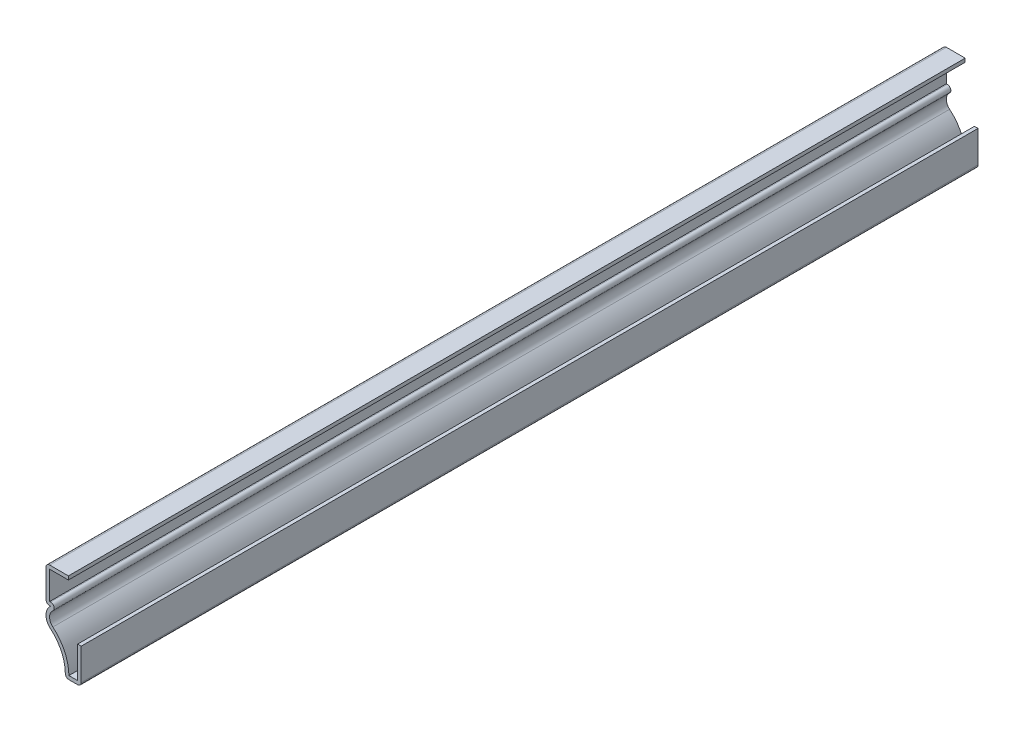
ISO-10303-21;
HEADER;
FILE_DESCRIPTION(('STEP AP214'),'2;1');
FILE_NAME('part.step','',(''),(''),'','','');
FILE_SCHEMA(('AUTOMOTIVE_DESIGN { 1 0 10303 214 1 1 1 1 }'));
ENDSEC;
DATA;
#1=APPLICATION_CONTEXT('core data for automotive mechanical design processes');
#2=APPLICATION_PROTOCOL_DEFINITION('international standard','automotive_design',2000,#1);
#3=PRODUCT_CONTEXT('',#1,'mechanical');
#4=PRODUCT('Part','Part','',(#3));
#5=PRODUCT_RELATED_PRODUCT_CATEGORY('part','',(#4));
#6=PRODUCT_DEFINITION_FORMATION('','',#4);
#7=PRODUCT_DEFINITION_CONTEXT('part definition',#1,'design');
#8=PRODUCT_DEFINITION('design','',#6,#7);
#9=PRODUCT_DEFINITION_SHAPE('','',#8);
#10=(LENGTH_UNIT() NAMED_UNIT(*) SI_UNIT(.MILLI.,.METRE.));
#11=(NAMED_UNIT(*) PLANE_ANGLE_UNIT() SI_UNIT($,.RADIAN.));
#12=(NAMED_UNIT(*) SI_UNIT($,.STERADIAN.) SOLID_ANGLE_UNIT());
#13=UNCERTAINTY_MEASURE_WITH_UNIT(LENGTH_MEASURE(1.E-05),#10,'distance_accuracy_value','');
#14=(GEOMETRIC_REPRESENTATION_CONTEXT(3) GLOBAL_UNCERTAINTY_ASSIGNED_CONTEXT((#13)) GLOBAL_UNIT_ASSIGNED_CONTEXT((#10,
#11,#12)) REPRESENTATION_CONTEXT('',''));
#15=CARTESIAN_POINT('',(0.,0.,0.));
#16=DIRECTION('',(0.,0.,1.));
#17=DIRECTION('',(1.,0.,0.));
#18=AXIS2_PLACEMENT_3D('',#15,#16,#17);
#19=CARTESIAN_POINT('',(0.,8.73125,-222.25));
#20=DIRECTION('',(0.,1.,0.));
#21=DIRECTION('',(0.,0.,1.));
#22=AXIS2_PLACEMENT_3D('',#19,#20,#21);
#23=PLANE('',#22);
#24=DIRECTION('',(-1.,0.,0.));
#25=VECTOR('',#24,1.);
#26=CARTESIAN_POINT('',(0.,8.73125,0.));
#27=LINE('',#26,#25);
#28=CARTESIAN_POINT('',(0.,8.73125,0.));
#29=VERTEX_POINT('',#28);
#30=CARTESIAN_POINT('',(-0.889,8.73125,0.));
#31=VERTEX_POINT('',#30);
#32=EDGE_CURVE('E252',#29,#31,#27,.T.);
#33=ORIENTED_EDGE('',*,*,#32,.F.);
#34=DIRECTION('',(0.,0.,1.));
#35=VECTOR('',#34,1.);
#36=CARTESIAN_POINT('',(0.,8.73125,-222.25));
#37=LINE('',#36,#35);
#38=CARTESIAN_POINT('',(0.,8.73125,-222.25));
#39=VERTEX_POINT('',#38);
#40=EDGE_CURVE('E208',#39,#29,#37,.T.);
#41=ORIENTED_EDGE('',*,*,#40,.F.);
#42=DIRECTION('',(-1.,0.,0.));
#43=VECTOR('',#42,1.);
#44=CARTESIAN_POINT('',(0.,8.73125,-222.25));
#45=LINE('',#44,#43);
#46=CARTESIAN_POINT('',(-0.889,8.73125,-222.25));
#47=VERTEX_POINT('',#46);
#48=EDGE_CURVE('E201',#39,#47,#45,.T.);
#49=ORIENTED_EDGE('',*,*,#48,.T.);
#50=DIRECTION('',(0.,0.,1.));
#51=VECTOR('',#50,1.);
#52=CARTESIAN_POINT('',(-0.889,8.73125,-222.25));
#53=LINE('',#52,#51);
#54=EDGE_CURVE('E183',#47,#31,#53,.T.);
#55=ORIENTED_EDGE('',*,*,#54,.T.);
#56=EDGE_LOOP('',(#33,#41,#49,#55));
#57=FACE_BOUND('',#56,.T.);
#58=ADVANCED_FACE('F39',(#57),#23,.T.);
#59=CARTESIAN_POINT('',(0.,8.73125,-222.25));
#60=DIRECTION('',(1.,0.,0.));
#61=DIRECTION('',(0.,1.,0.));
#62=AXIS2_PLACEMENT_3D('',#59,#60,#61);
#63=PLANE('',#62);
#64=DIRECTION('',(0.,1.,0.));
#65=VECTOR('',#64,1.);
#66=CARTESIAN_POINT('',(0.,8.73125,0.));
#67=LINE('',#66,#65);
#68=CARTESIAN_POINT('',(0.,0.888999999999999,0.));
#69=VERTEX_POINT('',#68);
#70=EDGE_CURVE('E209',#69,#29,#67,.T.);
#71=ORIENTED_EDGE('',*,*,#70,.F.);
#72=DIRECTION('',(0.,0.,1.));
#73=VECTOR('',#72,1.);
#74=CARTESIAN_POINT('',(0.,0.888999999999999,-222.25));
#75=LINE('',#74,#73);
#76=CARTESIAN_POINT('',(0.,0.888999999999999,-222.25));
#77=VERTEX_POINT('',#76);
#78=EDGE_CURVE('E11',#69,#77,#75,.F.);
#79=ORIENTED_EDGE('',*,*,#78,.T.);
#80=DIRECTION('',(0.,1.,0.));
#81=VECTOR('',#80,1.);
#82=CARTESIAN_POINT('',(0.,8.73125,-222.25));
#83=LINE('',#82,#81);
#84=EDGE_CURVE('E194',#77,#39,#83,.T.);
#85=ORIENTED_EDGE('',*,*,#84,.T.);
#86=ORIENTED_EDGE('',*,*,#40,.T.);
#87=EDGE_LOOP('',(#71,#79,#85,#86));
#88=FACE_BOUND('',#87,.T.);
#89=ADVANCED_FACE('F388',(#88),#63,.T.);
#90=CARTESIAN_POINT('',(0.,0.,-222.25));
#91=DIRECTION('',(0.,-1.,0.));
#92=DIRECTION('',(1.,0.,0.));
#93=AXIS2_PLACEMENT_3D('',#90,#91,#92);
#94=PLANE('',#93);
#95=DIRECTION('',(1.,0.,0.));
#96=VECTOR('',#95,1.);
#97=CARTESIAN_POINT('',(0.,0.,0.));
#98=LINE('',#97,#96);
#99=CARTESIAN_POINT('',(-3.05282102222703,0.,0.));
#100=VERTEX_POINT('',#99);
#101=CARTESIAN_POINT('',(-0.889,0.,0.));
#102=VERTEX_POINT('',#101);
#103=EDGE_CURVE('E211',#100,#102,#98,.T.);
#104=ORIENTED_EDGE('',*,*,#103,.F.);
#105=DIRECTION('',(0.,0.,1.));
#106=VECTOR('',#105,1.);
#107=CARTESIAN_POINT('',(-3.05282102222703,0.,-222.25));
#108=LINE('',#107,#106);
#109=CARTESIAN_POINT('',(-3.05282102222703,0.,-222.25));
#110=VERTEX_POINT('',#109);
#111=EDGE_CURVE('E332',#100,#110,#108,.F.);
#112=ORIENTED_EDGE('',*,*,#111,.T.);
#113=DIRECTION('',(1.,0.,0.));
#114=VECTOR('',#113,1.);
#115=CARTESIAN_POINT('',(0.,0.,-222.25));
#116=LINE('',#115,#114);
#117=CARTESIAN_POINT('',(-0.889,0.,-222.25));
#118=VERTEX_POINT('',#117);
#119=EDGE_CURVE('E248',#110,#118,#116,.T.);
#120=ORIENTED_EDGE('',*,*,#119,.T.);
#121=DIRECTION('',(0.,0.,1.));
#122=VECTOR('',#121,1.);
#123=CARTESIAN_POINT('',(-0.889,0.,-222.25));
#124=LINE('',#123,#122);
#125=EDGE_CURVE('E329',#118,#102,#124,.T.);
#126=ORIENTED_EDGE('',*,*,#125,.T.);
#127=EDGE_LOOP('',(#104,#112,#120,#126));
#128=FACE_BOUND('',#127,.T.);
#129=ADVANCED_FACE('F394',(#128),#94,.T.);
#130=CARTESIAN_POINT('',(-14.2597800204395,0.755845672681983,-222.25));
#131=DIRECTION('',(0.,0.,1.));
#132=DIRECTION('',(1.,0.,0.));
#133=AXIS2_PLACEMENT_3D('',#130,#131,#132);
#134=CYLINDRICAL_SURFACE('',#133,10.31875);
#135=CARTESIAN_POINT('',(-14.2597800204395,0.755845672681983,-222.25));
#136=DIRECTION('',(0.,0.,-1.));
#137=DIRECTION('',(1.,0.,0.));
#138=AXIS2_PLACEMENT_3D('',#135,#136,#137);
#139=CIRCLE('',#138,10.31875);
#140=CARTESIAN_POINT('',(-7.60413941657401,8.64121501816456,-222.25));
#141=VERTEX_POINT('',#140);
#142=CARTESIAN_POINT('',(-3.94175827987561,0.878438183668826,-222.25));
#143=VERTEX_POINT('',#142);
#144=EDGE_CURVE('E245',#141,#143,#139,.T.);
#145=ORIENTED_EDGE('',*,*,#144,.T.);
#146=DIRECTION('',(0.,0.,1.));
#147=VECTOR('',#146,1.);
#148=CARTESIAN_POINT('',(-3.94175827987561,0.878438183668826,-222.25));
#149=LINE('',#148,#147);
#150=CARTESIAN_POINT('',(-3.94175827987561,0.878438183668826,0.));
#151=VERTEX_POINT('',#150);
#152=EDGE_CURVE('E296',#143,#151,#149,.T.);
#153=ORIENTED_EDGE('',*,*,#152,.T.);
#154=CARTESIAN_POINT('',(-14.2597800204395,0.755845672681983,0.));
#155=DIRECTION('',(0.,0.,-1.));
#156=DIRECTION('',(1.,0.,0.));
#157=AXIS2_PLACEMENT_3D('',#154,#155,#156);
#158=CIRCLE('',#157,10.31875);
#159=CARTESIAN_POINT('',(-7.60413941657401,8.64121501816456,0.));
#160=VERTEX_POINT('',#159);
#161=EDGE_CURVE('E290',#160,#151,#158,.T.);
#162=ORIENTED_EDGE('',*,*,#161,.F.);
#163=DIRECTION('',(0.,0.,1.));
#164=VECTOR('',#163,1.);
#165=CARTESIAN_POINT('',(-7.60413941657401,8.64121501816456,-222.25));
#166=LINE('',#165,#164);
#167=EDGE_CURVE('E297',#141,#160,#166,.T.);
#168=ORIENTED_EDGE('',*,*,#167,.F.);
#169=EDGE_LOOP('',(#145,#153,#162,#168));
#170=FACE_BOUND('',#169,.T.);
#171=ADVANCED_FACE('F402',(#170),#134,.F.);
#172=CARTESIAN_POINT('',(-5.55625,11.0674825090823,-222.25));
#173=DIRECTION('',(0.,0.,1.));
#174=DIRECTION('',(1.,0.,0.));
#175=AXIS2_PLACEMENT_3D('',#172,#173,#174);
#176=CYLINDRICAL_SURFACE('',#175,3.175);
#177=CARTESIAN_POINT('',(-5.55625,11.0674825090823,0.));
#178=DIRECTION('',(0.,0.,1.));
#179=DIRECTION('',(-1.,0.,0.));
#180=AXIS2_PLACEMENT_3D('',#177,#178,#179);
#181=CIRCLE('',#180,3.175);
#182=CARTESIAN_POINT('',(-7.60413941657401,13.49375,0.));
#183=VERTEX_POINT('',#182);
#184=EDGE_CURVE('E287',#183,#160,#181,.T.);
#185=ORIENTED_EDGE('',*,*,#184,.F.);
#186=DIRECTION('',(0.,0.,1.));
#187=VECTOR('',#186,1.);
#188=CARTESIAN_POINT('',(-7.60413941657401,13.49375,-222.25));
#189=LINE('',#188,#187);
#190=CARTESIAN_POINT('',(-7.60413941657401,13.49375,-222.25));
#191=VERTEX_POINT('',#190);
#192=EDGE_CURVE('E299',#191,#183,#189,.T.);
#193=ORIENTED_EDGE('',*,*,#192,.F.);
#194=CARTESIAN_POINT('',(-5.55625,11.0674825090823,-222.25));
#195=DIRECTION('',(0.,0.,1.));
#196=DIRECTION('',(-1.,0.,0.));
#197=AXIS2_PLACEMENT_3D('',#194,#195,#196);
#198=CIRCLE('',#197,3.175);
#199=EDGE_CURVE('E242',#191,#141,#198,.T.);
#200=ORIENTED_EDGE('',*,*,#199,.T.);
#201=ORIENTED_EDGE('',*,*,#167,.T.);
#202=EDGE_LOOP('',(#185,#193,#200,#201));
#203=FACE_BOUND('',#202,.T.);
#204=ADVANCED_FACE('F408',(#203),#176,.T.);
#205=CARTESIAN_POINT('',(-7.60413941657401,13.49375,-222.25));
#206=DIRECTION('',(0.,-1.,0.));
#207=DIRECTION('',(0.,0.,-1.));
#208=AXIS2_PLACEMENT_3D('',#205,#206,#207);
#209=PLANE('',#208);
#210=DIRECTION('',(1.,0.,0.));
#211=VECTOR('',#210,1.);
#212=CARTESIAN_POINT('',(-7.60413941657401,13.49375,0.));
#213=LINE('',#212,#211);
#214=CARTESIAN_POINT('',(-7.84225,13.49375,0.));
#215=VERTEX_POINT('',#214);
#216=EDGE_CURVE('E285',#215,#183,#213,.T.);
#217=ORIENTED_EDGE('',*,*,#216,.F.);
#218=DIRECTION('',(0.,0.,1.));
#219=VECTOR('',#218,1.);
#220=CARTESIAN_POINT('',(-7.84225,13.49375,-222.25));
#221=LINE('',#220,#219);
#222=CARTESIAN_POINT('',(-7.84225,13.49375,-222.25));
#223=VERTEX_POINT('',#222);
#224=EDGE_CURVE('E345',#215,#223,#221,.F.);
#225=ORIENTED_EDGE('',*,*,#224,.T.);
#226=DIRECTION('',(1.,0.,0.));
#227=VECTOR('',#226,1.);
#228=CARTESIAN_POINT('',(-7.60413941657401,13.49375,-222.25));
#229=LINE('',#228,#227);
#230=EDGE_CURVE('E240',#223,#191,#229,.T.);
#231=ORIENTED_EDGE('',*,*,#230,.T.);
#232=ORIENTED_EDGE('',*,*,#192,.T.);
#233=EDGE_LOOP('',(#217,#225,#231,#232));
#234=FACE_BOUND('',#233,.T.);
#235=ADVANCED_FACE('F411',(#234),#209,.T.);
#236=CARTESIAN_POINT('',(-8.73125,13.49375,-222.25));
#237=DIRECTION('',(-1.,0.,0.));
#238=DIRECTION('',(0.,0.,1.));
#239=AXIS2_PLACEMENT_3D('',#236,#237,#238);
#240=PLANE('',#239);
#241=DIRECTION('',(0.,-1.,0.));
#242=VECTOR('',#241,1.);
#243=CARTESIAN_POINT('',(-8.73125,13.49375,-222.25));
#244=LINE('',#243,#242);
#245=CARTESIAN_POINT('',(-8.73125,21.336,-222.25));
#246=VERTEX_POINT('',#245);
#247=CARTESIAN_POINT('',(-8.73125,14.38275,-222.25));
#248=VERTEX_POINT('',#247);
#249=EDGE_CURVE('E238',#246,#248,#244,.T.);
#250=ORIENTED_EDGE('',*,*,#249,.T.);
#251=DIRECTION('',(0.,0.,1.));
#252=VECTOR('',#251,1.);
#253=CARTESIAN_POINT('',(-8.73125,14.38275,-222.25));
#254=LINE('',#253,#252);
#255=CARTESIAN_POINT('',(-8.73125,14.38275,0.));
#256=VERTEX_POINT('',#255);
#257=EDGE_CURVE('E342',#248,#256,#254,.T.);
#258=ORIENTED_EDGE('',*,*,#257,.T.);
#259=DIRECTION('',(0.,-1.,0.));
#260=VECTOR('',#259,1.);
#261=CARTESIAN_POINT('',(-8.73125,13.49375,0.));
#262=LINE('',#261,#260);
#263=CARTESIAN_POINT('',(-8.73125,21.336,0.));
#264=VERTEX_POINT('',#263);
#265=EDGE_CURVE('E282',#264,#256,#262,.T.);
#266=ORIENTED_EDGE('',*,*,#265,.F.);
#267=DIRECTION('',(0.,0.,1.));
#268=VECTOR('',#267,1.);
#269=CARTESIAN_POINT('',(-8.73125,21.336,-222.25));
#270=LINE('',#269,#268);
#271=EDGE_CURVE('E340',#264,#246,#270,.F.);
#272=ORIENTED_EDGE('',*,*,#271,.T.);
#273=EDGE_LOOP('',(#250,#258,#266,#272));
#274=FACE_BOUND('',#273,.T.);
#275=ADVANCED_FACE('F417',(#274),#240,.T.);
#276=CARTESIAN_POINT('',(-8.73125,22.225,-222.25));
#277=DIRECTION('',(0.,1.,0.));
#278=DIRECTION('',(-1.,0.,0.));
#279=AXIS2_PLACEMENT_3D('',#276,#277,#278);
#280=PLANE('',#279);
#281=DIRECTION('',(-1.,0.,0.));
#282=VECTOR('',#281,1.);
#283=CARTESIAN_POINT('',(-8.73125,22.225,-222.25));
#284=LINE('',#283,#282);
#285=CARTESIAN_POINT('',(-3.175,22.225,-222.25));
#286=VERTEX_POINT('',#285);
#287=CARTESIAN_POINT('',(-7.84225,22.225,-222.25));
#288=VERTEX_POINT('',#287);
#289=EDGE_CURVE('E236',#286,#288,#284,.T.);
#290=ORIENTED_EDGE('',*,*,#289,.T.);
#291=DIRECTION('',(0.,0.,1.));
#292=VECTOR('',#291,1.);
#293=CARTESIAN_POINT('',(-7.84225,22.225,-222.25));
#294=LINE('',#293,#292);
#295=CARTESIAN_POINT('',(-7.84225,22.225,0.));
#296=VERTEX_POINT('',#295);
#297=EDGE_CURVE('E47',#288,#296,#294,.T.);
#298=ORIENTED_EDGE('',*,*,#297,.T.);
#299=DIRECTION('',(-1.,0.,0.));
#300=VECTOR('',#299,1.);
#301=CARTESIAN_POINT('',(-8.73125,22.225,0.));
#302=LINE('',#301,#300);
#303=CARTESIAN_POINT('',(-3.175,22.225,0.));
#304=VERTEX_POINT('',#303);
#305=EDGE_CURVE('E279',#304,#296,#302,.T.);
#306=ORIENTED_EDGE('',*,*,#305,.F.);
#307=DIRECTION('',(0.,0.,1.));
#308=VECTOR('',#307,1.);
#309=CARTESIAN_POINT('',(-3.175,22.225,-222.25));
#310=LINE('',#309,#308);
#311=EDGE_CURVE('E302',#286,#304,#310,.T.);
#312=ORIENTED_EDGE('',*,*,#311,.F.);
#313=EDGE_LOOP('',(#290,#298,#306,#312));
#314=FACE_BOUND('',#313,.T.);
#315=ADVANCED_FACE('F350',(#314),#280,.T.);
#316=CARTESIAN_POINT('',(-3.175,22.225,-222.25));
#317=DIRECTION('',(1.,0.,0.));
#318=DIRECTION('',(0.,0.,-1.));
#319=AXIS2_PLACEMENT_3D('',#316,#317,#318);
#320=PLANE('',#319);
#321=DIRECTION('',(0.,1.,0.));
#322=VECTOR('',#321,1.);
#323=CARTESIAN_POINT('',(-3.175,22.225,0.));
#324=LINE('',#323,#322);
#325=CARTESIAN_POINT('',(-3.175,21.336,0.));
#326=VERTEX_POINT('',#325);
#327=EDGE_CURVE('E276',#326,#304,#324,.T.);
#328=ORIENTED_EDGE('',*,*,#327,.F.);
#329=DIRECTION('',(0.,0.,1.));
#330=VECTOR('',#329,1.);
#331=CARTESIAN_POINT('',(-3.175,21.336,-222.25));
#332=LINE('',#331,#330);
#333=CARTESIAN_POINT('',(-3.175,21.336,-222.25));
#334=VERTEX_POINT('',#333);
#335=EDGE_CURVE('E304',#334,#326,#332,.T.);
#336=ORIENTED_EDGE('',*,*,#335,.F.);
#337=DIRECTION('',(0.,1.,0.));
#338=VECTOR('',#337,1.);
#339=CARTESIAN_POINT('',(-3.175,22.225,-222.25));
#340=LINE('',#339,#338);
#341=EDGE_CURVE('E233',#334,#286,#340,.T.);
#342=ORIENTED_EDGE('',*,*,#341,.T.);
#343=ORIENTED_EDGE('',*,*,#311,.T.);
#344=EDGE_LOOP('',(#328,#336,#342,#343));
#345=FACE_BOUND('',#344,.T.);
#346=ADVANCED_FACE('F358',(#345),#320,.T.);
#347=CARTESIAN_POINT('',(-7.84225,21.336,-222.25));
#348=DIRECTION('',(0.,-1.,0.));
#349=DIRECTION('',(0.,0.,-1.));
#350=AXIS2_PLACEMENT_3D('',#347,#348,#349);
#351=PLANE('',#350);
#352=DIRECTION('',(1.,0.,0.));
#353=VECTOR('',#352,1.);
#354=CARTESIAN_POINT('',(-7.84225,21.336,0.));
#355=LINE('',#354,#353);
#356=CARTESIAN_POINT('',(-7.84225,21.336,0.));
#357=VERTEX_POINT('',#356);
#358=EDGE_CURVE('E273',#357,#326,#355,.T.);
#359=ORIENTED_EDGE('',*,*,#358,.F.);
#360=DIRECTION('',(0.,0.,1.));
#361=VECTOR('',#360,1.);
#362=CARTESIAN_POINT('',(-7.84225,21.336,-222.25));
#363=LINE('',#362,#361);
#364=CARTESIAN_POINT('',(-7.84225,21.336,-222.25));
#365=VERTEX_POINT('',#364);
#366=EDGE_CURVE('E306',#365,#357,#363,.T.);
#367=ORIENTED_EDGE('',*,*,#366,.F.);
#368=DIRECTION('',(1.,0.,0.));
#369=VECTOR('',#368,1.);
#370=CARTESIAN_POINT('',(-7.84225,21.336,-222.25));
#371=LINE('',#370,#369);
#372=EDGE_CURVE('E230',#365,#334,#371,.T.);
#373=ORIENTED_EDGE('',*,*,#372,.T.);
#374=ORIENTED_EDGE('',*,*,#335,.T.);
#375=EDGE_LOOP('',(#359,#367,#373,#374));
#376=FACE_BOUND('',#375,.T.);
#377=ADVANCED_FACE('F363',(#376),#351,.T.);
#378=CARTESIAN_POINT('',(-7.84225,14.38275,-222.25));
#379=DIRECTION('',(1.,0.,0.));
#380=DIRECTION('',(0.,0.,-1.));
#381=AXIS2_PLACEMENT_3D('',#378,#379,#380);
#382=PLANE('',#381);
#383=DIRECTION('',(0.,1.,0.));
#384=VECTOR('',#383,1.);
#385=CARTESIAN_POINT('',(-7.84225,14.38275,0.));
#386=LINE('',#385,#384);
#387=CARTESIAN_POINT('',(-7.84225,14.38275,0.));
#388=VERTEX_POINT('',#387);
#389=EDGE_CURVE('E270',#388,#357,#386,.T.);
#390=ORIENTED_EDGE('',*,*,#389,.F.);
#391=DIRECTION('',(0.,0.,1.));
#392=VECTOR('',#391,1.);
#393=CARTESIAN_POINT('',(-7.84225,14.38275,-222.25));
#394=LINE('',#393,#392);
#395=CARTESIAN_POINT('',(-7.84225,14.38275,-222.25));
#396=VERTEX_POINT('',#395);
#397=EDGE_CURVE('E308',#396,#388,#394,.T.);
#398=ORIENTED_EDGE('',*,*,#397,.F.);
#399=DIRECTION('',(0.,1.,0.));
#400=VECTOR('',#399,1.);
#401=CARTESIAN_POINT('',(-7.84225,14.38275,-222.25));
#402=LINE('',#401,#400);
#403=EDGE_CURVE('E227',#396,#365,#402,.T.);
#404=ORIENTED_EDGE('',*,*,#403,.T.);
#405=ORIENTED_EDGE('',*,*,#366,.T.);
#406=EDGE_LOOP('',(#390,#398,#404,#405));
#407=FACE_BOUND('',#406,.T.);
#408=ADVANCED_FACE('F366',(#407),#382,.T.);
#409=CARTESIAN_POINT('',(-7.60413941657401,14.38275,-222.25));
#410=DIRECTION('',(0.,1.,0.));
#411=DIRECTION('',(0.,0.,1.));
#412=AXIS2_PLACEMENT_3D('',#409,#410,#411);
#413=PLANE('',#412);
#414=DIRECTION('',(-1.,0.,0.));
#415=VECTOR('',#414,1.);
#416=CARTESIAN_POINT('',(-7.60413941657401,14.38275,0.));
#417=LINE('',#416,#415);
#418=CARTESIAN_POINT('',(-7.60413941657401,14.38275,0.));
#419=VERTEX_POINT('',#418);
#420=EDGE_CURVE('E267',#419,#388,#417,.T.);
#421=ORIENTED_EDGE('',*,*,#420,.F.);
#422=DIRECTION('',(0.,0.,1.));
#423=VECTOR('',#422,1.);
#424=CARTESIAN_POINT('',(-7.60413941657401,14.38275,-222.25));
#425=LINE('',#424,#423);
#426=CARTESIAN_POINT('',(-7.60413941657401,14.38275,-222.25));
#427=VERTEX_POINT('',#426);
#428=EDGE_CURVE('E310',#427,#419,#425,.T.);
#429=ORIENTED_EDGE('',*,*,#428,.F.);
#430=DIRECTION('',(-1.,0.,0.));
#431=VECTOR('',#430,1.);
#432=CARTESIAN_POINT('',(-7.60413941657401,14.38275,-222.25));
#433=LINE('',#432,#431);
#434=EDGE_CURVE('E224',#427,#396,#433,.T.);
#435=ORIENTED_EDGE('',*,*,#434,.T.);
#436=ORIENTED_EDGE('',*,*,#397,.T.);
#437=EDGE_LOOP('',(#421,#429,#435,#436));
#438=FACE_BOUND('',#437,.T.);
#439=ADVANCED_FACE('F371',(#438),#413,.T.);
#440=CARTESIAN_POINT('',(-7.60413941657401,13.49375,-222.25));
#441=DIRECTION('',(0.,0.,1.));
#442=DIRECTION('',(1.,0.,0.));
#443=AXIS2_PLACEMENT_3D('',#440,#441,#442);
#444=CYLINDRICAL_SURFACE('',#443,0.888999999999998);
#445=CARTESIAN_POINT('',(-7.60413941657401,13.49375,0.));
#446=DIRECTION('',(0.,0.,1.));
#447=DIRECTION('',(1.,0.,0.));
#448=AXIS2_PLACEMENT_3D('',#445,#446,#447);
#449=CIRCLE('',#448,0.888999999999998);
#450=CARTESIAN_POINT('',(-7.03073037993329,12.814395102543,0.));
#451=VERTEX_POINT('',#450);
#452=EDGE_CURVE('E264',#451,#419,#449,.T.);
#453=ORIENTED_EDGE('',*,*,#452,.F.);
#454=DIRECTION('',(0.,0.,1.));
#455=VECTOR('',#454,1.);
#456=CARTESIAN_POINT('',(-7.03073037993329,12.814395102543,-222.25));
#457=LINE('',#456,#455);
#458=CARTESIAN_POINT('',(-7.03073037993329,12.814395102543,-222.25));
#459=VERTEX_POINT('',#458);
#460=EDGE_CURVE('E312',#459,#451,#457,.T.);
#461=ORIENTED_EDGE('',*,*,#460,.F.);
#462=CARTESIAN_POINT('',(-7.60413941657401,13.49375,-222.25));
#463=DIRECTION('',(0.,0.,1.));
#464=DIRECTION('',(1.,0.,0.));
#465=AXIS2_PLACEMENT_3D('',#462,#463,#464);
#466=CIRCLE('',#465,0.888999999999998);
#467=EDGE_CURVE('E221',#459,#427,#466,.T.);
#468=ORIENTED_EDGE('',*,*,#467,.T.);
#469=ORIENTED_EDGE('',*,*,#428,.T.);
#470=EDGE_LOOP('',(#453,#461,#468,#469));
#471=FACE_BOUND('',#470,.T.);
#472=ADVANCED_FACE('F374',(#471),#444,.T.);
#473=CARTESIAN_POINT('',(-5.55625,11.0674825090823,-222.25));
#474=DIRECTION('',(0.,0.,1.));
#475=DIRECTION('',(1.,0.,0.));
#476=AXIS2_PLACEMENT_3D('',#473,#474,#475);
#477=CYLINDRICAL_SURFACE('',#476,2.286);
#478=CARTESIAN_POINT('',(-5.55625,11.0674825090823,0.));
#479=DIRECTION('',(0.,0.,-1.));
#480=DIRECTION('',(-1.,0.,0.));
#481=AXIS2_PLACEMENT_3D('',#478,#479,#480);
#482=CIRCLE('',#481,2.286);
#483=CARTESIAN_POINT('',(-7.03073037993328,9.32056991562152,0.));
#484=VERTEX_POINT('',#483);
#485=EDGE_CURVE('E261',#484,#451,#482,.T.);
#486=ORIENTED_EDGE('',*,*,#485,.F.);
#487=DIRECTION('',(0.,0.,1.));
#488=VECTOR('',#487,1.);
#489=CARTESIAN_POINT('',(-7.03073037993328,9.32056991562152,-222.25));
#490=LINE('',#489,#488);
#491=CARTESIAN_POINT('',(-7.03073037993328,9.32056991562152,-222.25));
#492=VERTEX_POINT('',#491);
#493=EDGE_CURVE('E314',#492,#484,#490,.T.);
#494=ORIENTED_EDGE('',*,*,#493,.F.);
#495=CARTESIAN_POINT('',(-5.55625,11.0674825090823,-222.25));
#496=DIRECTION('',(0.,0.,-1.));
#497=DIRECTION('',(-1.,0.,0.));
#498=AXIS2_PLACEMENT_3D('',#495,#496,#497);
#499=CIRCLE('',#498,2.286);
#500=EDGE_CURVE('E218',#492,#459,#499,.T.);
#501=ORIENTED_EDGE('',*,*,#500,.T.);
#502=ORIENTED_EDGE('',*,*,#460,.T.);
#503=EDGE_LOOP('',(#486,#494,#501,#502));
#504=FACE_BOUND('',#503,.T.);
#505=ADVANCED_FACE('F378',(#504),#477,.F.);
#506=CARTESIAN_POINT('',(-14.2597800204395,0.755845672681983,-222.25));
#507=DIRECTION('',(0.,0.,1.));
#508=DIRECTION('',(1.,0.,0.));
#509=AXIS2_PLACEMENT_3D('',#506,#507,#508);
#510=CYLINDRICAL_SURFACE('',#509,11.20775);
#511=CARTESIAN_POINT('',(-14.2597800204395,0.755845672681983,0.));
#512=DIRECTION('',(0.,0.,1.));
#513=DIRECTION('',(1.,0.,0.));
#514=AXIS2_PLACEMENT_3D('',#511,#512,#513);
#515=CIRCLE('',#514,11.20775);
#516=CARTESIAN_POINT('',(-3.05282102222703,0.889,0.));
#517=VERTEX_POINT('',#516);
#518=EDGE_CURVE('E258',#517,#484,#515,.T.);
#519=ORIENTED_EDGE('',*,*,#518,.F.);
#520=DIRECTION('',(0.,0.,1.));
#521=VECTOR('',#520,1.);
#522=CARTESIAN_POINT('',(-3.05282102222703,0.889,-222.25));
#523=LINE('',#522,#521);
#524=CARTESIAN_POINT('',(-3.05282102222703,0.889,-222.25));
#525=VERTEX_POINT('',#524);
#526=EDGE_CURVE('E316',#525,#517,#523,.T.);
#527=ORIENTED_EDGE('',*,*,#526,.F.);
#528=CARTESIAN_POINT('',(-14.2597800204395,0.755845672681983,-222.25));
#529=DIRECTION('',(0.,0.,1.));
#530=DIRECTION('',(1.,0.,0.));
#531=AXIS2_PLACEMENT_3D('',#528,#529,#530);
#532=CIRCLE('',#531,11.20775);
#533=EDGE_CURVE('E215',#525,#492,#532,.T.);
#534=ORIENTED_EDGE('',*,*,#533,.T.);
#535=ORIENTED_EDGE('',*,*,#493,.T.);
#536=EDGE_LOOP('',(#519,#527,#534,#535));
#537=FACE_BOUND('',#536,.T.);
#538=ADVANCED_FACE('F381',(#537),#510,.T.);
#539=CARTESIAN_POINT('',(-0.889,0.889,-222.25));
#540=DIRECTION('',(0.,1.,0.));
#541=DIRECTION('',(0.,0.,1.));
#542=AXIS2_PLACEMENT_3D('',#539,#540,#541);
#543=PLANE('',#542);
#544=DIRECTION('',(-1.,0.,0.));
#545=VECTOR('',#544,1.);
#546=CARTESIAN_POINT('',(-0.889,0.889,0.));
#547=LINE('',#546,#545);
#548=CARTESIAN_POINT('',(-0.889,0.889,0.));
#549=VERTEX_POINT('',#548);
#550=EDGE_CURVE('E255',#549,#517,#547,.T.);
#551=ORIENTED_EDGE('',*,*,#550,.F.);
#552=DIRECTION('',(0.,0.,1.));
#553=VECTOR('',#552,1.);
#554=CARTESIAN_POINT('',(-0.889,0.889,-222.25));
#555=LINE('',#554,#553);
#556=CARTESIAN_POINT('',(-0.889,0.889,-222.25));
#557=VERTEX_POINT('',#556);
#558=EDGE_CURVE('E193',#557,#549,#555,.T.);
#559=ORIENTED_EDGE('',*,*,#558,.F.);
#560=DIRECTION('',(-1.,0.,0.));
#561=VECTOR('',#560,1.);
#562=CARTESIAN_POINT('',(-0.889,0.889,-222.25));
#563=LINE('',#562,#561);
#564=EDGE_CURVE('E204',#557,#525,#563,.T.);
#565=ORIENTED_EDGE('',*,*,#564,.T.);
#566=ORIENTED_EDGE('',*,*,#526,.T.);
#567=EDGE_LOOP('',(#551,#559,#565,#566));
#568=FACE_BOUND('',#567,.T.);
#569=ADVANCED_FACE('F384',(#568),#543,.T.);
#570=CARTESIAN_POINT('',(-0.889,8.73125,-222.25));
#571=DIRECTION('',(-1.,0.,0.));
#572=DIRECTION('',(0.,0.,1.));
#573=AXIS2_PLACEMENT_3D('',#570,#571,#572);
#574=PLANE('',#573);
#575=DIRECTION('',(0.,-1.,0.));
#576=VECTOR('',#575,1.);
#577=CARTESIAN_POINT('',(-0.889,8.73125,0.));
#578=LINE('',#577,#576);
#579=EDGE_CURVE('E188',#31,#549,#578,.T.);
#580=ORIENTED_EDGE('',*,*,#579,.F.);
#581=ORIENTED_EDGE('',*,*,#54,.F.);
#582=DIRECTION('',(0.,-1.,0.));
#583=VECTOR('',#582,1.);
#584=CARTESIAN_POINT('',(-0.889,8.73125,-222.25));
#585=LINE('',#584,#583);
#586=EDGE_CURVE('E186',#47,#557,#585,.T.);
#587=ORIENTED_EDGE('',*,*,#586,.T.);
#588=ORIENTED_EDGE('',*,*,#558,.T.);
#589=EDGE_LOOP('',(#580,#581,#587,#588));
#590=FACE_BOUND('',#589,.T.);
#591=ADVANCED_FACE('F185',(#590),#574,.T.);
#592=CARTESIAN_POINT('',(-14.2597800204395,0.755845672681983,-222.25));
#593=DIRECTION('',(0.,0.,1.));
#594=DIRECTION('',(1.,0.,0.));
#595=AXIS2_PLACEMENT_3D('',#592,#593,#594);
#596=PLANE('',#595);
#597=ORIENTED_EDGE('',*,*,#119,.F.);
#598=CARTESIAN_POINT('',(-3.05282102222703,0.889,-222.25));
#599=DIRECTION('',(0.,0.,1.));
#600=DIRECTION('',(1.,0.,0.));
#601=AXIS2_PLACEMENT_3D('',#598,#599,#600);
#602=CIRCLE('',#601,0.889);
#603=EDGE_CURVE('E338',#110,#143,#602,.F.);
#604=ORIENTED_EDGE('',*,*,#603,.T.);
#605=ORIENTED_EDGE('',*,*,#144,.F.);
#606=ORIENTED_EDGE('',*,*,#199,.F.);
#607=ORIENTED_EDGE('',*,*,#230,.F.);
#608=CARTESIAN_POINT('',(-7.84225,14.38275,-222.25));
#609=DIRECTION('',(0.,0.,1.));
#610=DIRECTION('',(1.,0.,0.));
#611=AXIS2_PLACEMENT_3D('',#608,#609,#610);
#612=CIRCLE('',#611,0.889);
#613=EDGE_CURVE('E60',#223,#248,#612,.F.);
#614=ORIENTED_EDGE('',*,*,#613,.T.);
#615=ORIENTED_EDGE('',*,*,#249,.F.);
#616=CARTESIAN_POINT('',(-7.84225,21.336,-222.25));
#617=DIRECTION('',(0.,0.,1.));
#618=DIRECTION('',(1.,0.,0.));
#619=AXIS2_PLACEMENT_3D('',#616,#617,#618);
#620=CIRCLE('',#619,0.889);
#621=EDGE_CURVE('E54',#246,#288,#620,.F.);
#622=ORIENTED_EDGE('',*,*,#621,.T.);
#623=ORIENTED_EDGE('',*,*,#289,.F.);
#624=ORIENTED_EDGE('',*,*,#341,.F.);
#625=ORIENTED_EDGE('',*,*,#372,.F.);
#626=ORIENTED_EDGE('',*,*,#403,.F.);
#627=ORIENTED_EDGE('',*,*,#434,.F.);
#628=ORIENTED_EDGE('',*,*,#467,.F.);
#629=ORIENTED_EDGE('',*,*,#500,.F.);
#630=ORIENTED_EDGE('',*,*,#533,.F.);
#631=ORIENTED_EDGE('',*,*,#564,.F.);
#632=ORIENTED_EDGE('',*,*,#586,.F.);
#633=ORIENTED_EDGE('',*,*,#48,.F.);
#634=ORIENTED_EDGE('',*,*,#84,.F.);
#635=CARTESIAN_POINT('',(-0.889,0.889,-222.25));
#636=DIRECTION('',(0.,0.,1.));
#637=DIRECTION('',(1.,0.,0.));
#638=AXIS2_PLACEMENT_3D('',#635,#636,#637);
#639=CIRCLE('',#638,0.889);
#640=EDGE_CURVE('E334',#77,#118,#639,.F.);
#641=ORIENTED_EDGE('',*,*,#640,.T.);
#642=EDGE_LOOP('',(#597,#604,#605,#606,#607,#614,#615,#622,#623,#624,#625,#626,#627,#628,#629,
#630,#631,#632,#633,#634,#641));
#643=FACE_BOUND('',#642,.T.);
#644=ADVANCED_FACE('F199',(#643),#596,.F.);
#645=CARTESIAN_POINT('',(-14.2597800204395,0.755845672681983,0.));
#646=DIRECTION('',(0.,0.,1.));
#647=DIRECTION('',(1.,0.,0.));
#648=AXIS2_PLACEMENT_3D('',#645,#646,#647);
#649=PLANE('',#648);
#650=ORIENTED_EDGE('',*,*,#161,.T.);
#651=CARTESIAN_POINT('',(-3.05282102222703,0.889,0.));
#652=DIRECTION('',(0.,0.,1.));
#653=DIRECTION('',(1.,0.,0.));
#654=AXIS2_PLACEMENT_3D('',#651,#652,#653);
#655=CIRCLE('',#654,0.889);
#656=EDGE_CURVE('E327',#151,#100,#655,.T.);
#657=ORIENTED_EDGE('',*,*,#656,.T.);
#658=ORIENTED_EDGE('',*,*,#103,.T.);
#659=CARTESIAN_POINT('',(-0.889,0.889,0.));
#660=DIRECTION('',(0.,0.,1.));
#661=DIRECTION('',(1.,0.,0.));
#662=AXIS2_PLACEMENT_3D('',#659,#660,#661);
#663=CIRCLE('',#662,0.889);
#664=EDGE_CURVE('E321',#102,#69,#663,.T.);
#665=ORIENTED_EDGE('',*,*,#664,.T.);
#666=ORIENTED_EDGE('',*,*,#70,.T.);
#667=ORIENTED_EDGE('',*,*,#32,.T.);
#668=ORIENTED_EDGE('',*,*,#579,.T.);
#669=ORIENTED_EDGE('',*,*,#550,.T.);
#670=ORIENTED_EDGE('',*,*,#518,.T.);
#671=ORIENTED_EDGE('',*,*,#485,.T.);
#672=ORIENTED_EDGE('',*,*,#452,.T.);
#673=ORIENTED_EDGE('',*,*,#420,.T.);
#674=ORIENTED_EDGE('',*,*,#389,.T.);
#675=ORIENTED_EDGE('',*,*,#358,.T.);
#676=ORIENTED_EDGE('',*,*,#327,.T.);
#677=ORIENTED_EDGE('',*,*,#305,.T.);
#678=CARTESIAN_POINT('',(-7.84225,21.336,0.));
#679=DIRECTION('',(0.,0.,1.));
#680=DIRECTION('',(1.,0.,0.));
#681=AXIS2_PLACEMENT_3D('',#678,#679,#680);
#682=CIRCLE('',#681,0.889);
#683=EDGE_CURVE('E323',#296,#264,#682,.T.);
#684=ORIENTED_EDGE('',*,*,#683,.T.);
#685=ORIENTED_EDGE('',*,*,#265,.T.);
#686=CARTESIAN_POINT('',(-7.84225,14.38275,0.));
#687=DIRECTION('',(0.,0.,1.));
#688=DIRECTION('',(1.,0.,0.));
#689=AXIS2_PLACEMENT_3D('',#686,#687,#688);
#690=CIRCLE('',#689,0.889);
#691=EDGE_CURVE('E325',#256,#215,#690,.T.);
#692=ORIENTED_EDGE('',*,*,#691,.T.);
#693=ORIENTED_EDGE('',*,*,#216,.T.);
#694=ORIENTED_EDGE('',*,*,#184,.T.);
#695=EDGE_LOOP('',(#650,#657,#658,#665,#666,#667,#668,#669,#670,#671,#672,#673,#674,#675,#676,
#677,#684,#685,#692,#693,#694));
#696=FACE_BOUND('',#695,.T.);
#697=ADVANCED_FACE('F353',(#696),#649,.T.);
#698=CARTESIAN_POINT('',(-3.05282102222703,0.889,-222.25));
#699=DIRECTION('',(0.,0.,1.));
#700=DIRECTION('',(1.,0.,0.));
#701=AXIS2_PLACEMENT_3D('',#698,#699,#700);
#702=CYLINDRICAL_SURFACE('',#701,0.889);
#703=ORIENTED_EDGE('',*,*,#603,.F.);
#704=ORIENTED_EDGE('',*,*,#111,.F.);
#705=ORIENTED_EDGE('',*,*,#656,.F.);
#706=ORIENTED_EDGE('',*,*,#152,.F.);
#707=EDGE_LOOP('',(#703,#704,#705,#706));
#708=FACE_BOUND('',#707,.T.);
#709=ADVANCED_FACE('F400',(#708),#702,.T.);
#710=CARTESIAN_POINT('',(-7.84225,14.38275,-222.25));
#711=DIRECTION('',(0.,0.,1.));
#712=DIRECTION('',(1.,0.,0.));
#713=AXIS2_PLACEMENT_3D('',#710,#711,#712);
#714=CYLINDRICAL_SURFACE('',#713,0.889);
#715=ORIENTED_EDGE('',*,*,#613,.F.);
#716=ORIENTED_EDGE('',*,*,#224,.F.);
#717=ORIENTED_EDGE('',*,*,#691,.F.);
#718=ORIENTED_EDGE('',*,*,#257,.F.);
#719=EDGE_LOOP('',(#715,#716,#717,#718));
#720=FACE_BOUND('',#719,.T.);
#721=ADVANCED_FACE('F415',(#720),#714,.T.);
#722=CARTESIAN_POINT('',(-7.84225,21.336,-222.25));
#723=DIRECTION('',(0.,0.,1.));
#724=DIRECTION('',(1.,0.,0.));
#725=AXIS2_PLACEMENT_3D('',#722,#723,#724);
#726=CYLINDRICAL_SURFACE('',#725,0.889);
#727=ORIENTED_EDGE('',*,*,#621,.F.);
#728=ORIENTED_EDGE('',*,*,#271,.F.);
#729=ORIENTED_EDGE('',*,*,#683,.F.);
#730=ORIENTED_EDGE('',*,*,#297,.F.);
#731=EDGE_LOOP('',(#727,#728,#729,#730));
#732=FACE_BOUND('',#731,.T.);
#733=ADVANCED_FACE('F419',(#732),#726,.T.);
#734=CARTESIAN_POINT('',(-0.889,0.889,-222.25));
#735=DIRECTION('',(0.,0.,1.));
#736=DIRECTION('',(1.,0.,0.));
#737=AXIS2_PLACEMENT_3D('',#734,#735,#736);
#738=CYLINDRICAL_SURFACE('',#737,0.889);
#739=ORIENTED_EDGE('',*,*,#640,.F.);
#740=ORIENTED_EDGE('',*,*,#78,.F.);
#741=ORIENTED_EDGE('',*,*,#664,.F.);
#742=ORIENTED_EDGE('',*,*,#125,.F.);
#743=EDGE_LOOP('',(#739,#740,#741,#742));
#744=FACE_BOUND('',#743,.T.);
#745=ADVANCED_FACE('F41',(#744),#738,.T.);
#746=CLOSED_SHELL('',(#58,#89,#129,#171,#204,#235,#275,#315,#346,#377,#408,#439,#472,#505,#538,
#569,#591,#644,#697,#709,#721,#733,#745));
#747=MANIFOLD_SOLID_BREP('B2',#746);
#748=ADVANCED_BREP_SHAPE_REPRESENTATION('',(#18,#747),#14);
#749=SHAPE_DEFINITION_REPRESENTATION(#9,#748);
ENDSEC;
END-ISO-10303-21;
